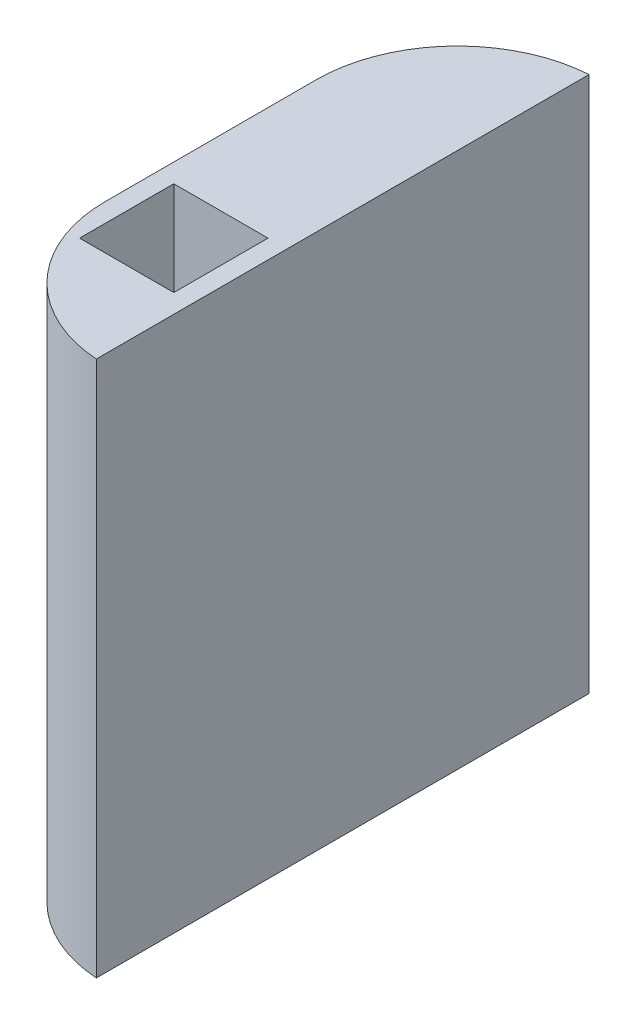
ISO-10303-21;
HEADER;
FILE_DESCRIPTION(('STEP AP214'),'2;1');
FILE_NAME('part.step','',(''),(''),'','','');
FILE_SCHEMA(('AUTOMOTIVE_DESIGN { 1 0 10303 214 1 1 1 1 }'));
ENDSEC;
DATA;
#1=APPLICATION_CONTEXT('core data for automotive mechanical design processes');
#2=APPLICATION_PROTOCOL_DEFINITION('international standard','automotive_design',2000,#1);
#3=PRODUCT_CONTEXT('',#1,'mechanical');
#4=PRODUCT('Part','Part','',(#3));
#5=PRODUCT_RELATED_PRODUCT_CATEGORY('part','',(#4));
#6=PRODUCT_DEFINITION_FORMATION('','',#4);
#7=PRODUCT_DEFINITION_CONTEXT('part definition',#1,'design');
#8=PRODUCT_DEFINITION('design','',#6,#7);
#9=PRODUCT_DEFINITION_SHAPE('','',#8);
#10=(LENGTH_UNIT() NAMED_UNIT(*) SI_UNIT(.MILLI.,.METRE.));
#11=(NAMED_UNIT(*) PLANE_ANGLE_UNIT() SI_UNIT($,.RADIAN.));
#12=(NAMED_UNIT(*) SI_UNIT($,.STERADIAN.) SOLID_ANGLE_UNIT());
#13=UNCERTAINTY_MEASURE_WITH_UNIT(LENGTH_MEASURE(1.E-05),#10,'distance_accuracy_value','');
#14=(GEOMETRIC_REPRESENTATION_CONTEXT(3) GLOBAL_UNCERTAINTY_ASSIGNED_CONTEXT((#13)) GLOBAL_UNIT_ASSIGNED_CONTEXT((#10,
#11,#12)) REPRESENTATION_CONTEXT('',''));
#15=CARTESIAN_POINT('',(0.,0.,0.));
#16=DIRECTION('',(0.,0.,1.));
#17=DIRECTION('',(1.,0.,0.));
#18=AXIS2_PLACEMENT_3D('',#15,#16,#17);
#19=CARTESIAN_POINT('',(0.,56.9,0.));
#20=DIRECTION('',(0.,1.,0.));
#21=DIRECTION('',(0.,0.,1.));
#22=AXIS2_PLACEMENT_3D('',#19,#20,#21);
#23=PLANE('',#22);
#24=DIRECTION('',(0.,0.,-1.));
#25=VECTOR('',#24,1.);
#26=CARTESIAN_POINT('',(7.,56.9,-26.15));
#27=LINE('',#26,#25);
#28=CARTESIAN_POINT('',(7.,56.9,26.15));
#29=VERTEX_POINT('',#28);
#30=CARTESIAN_POINT('',(7.,56.9,-26.15));
#31=VERTEX_POINT('',#30);
#32=EDGE_CURVE('E143',#29,#31,#27,.T.);
#33=ORIENTED_EDGE('',*,*,#32,.T.);
#34=CARTESIAN_POINT('',(8.,56.9,-11.1833704529042));
#35=DIRECTION('',(0.,1.,0.));
#36=DIRECTION('',(0.,0.,1.));
#37=AXIS2_PLACEMENT_3D('',#34,#35,#36);
#38=CIRCLE('',#37,15.);
#39=CARTESIAN_POINT('',(-7.,56.9,-11.1833704529042));
#40=VERTEX_POINT('',#39);
#41=EDGE_CURVE('E11',#31,#40,#38,.T.);
#42=ORIENTED_EDGE('',*,*,#41,.T.);
#43=DIRECTION('',(0.,0.,1.));
#44=VECTOR('',#43,1.);
#45=CARTESIAN_POINT('',(-7.,56.9,-26.15));
#46=LINE('',#45,#44);
#47=CARTESIAN_POINT('',(-7.,56.9,11.1833704529042));
#48=VERTEX_POINT('',#47);
#49=EDGE_CURVE('E145',#40,#48,#46,.T.);
#50=ORIENTED_EDGE('',*,*,#49,.T.);
#51=CARTESIAN_POINT('',(8.,56.9,11.1833704529042));
#52=DIRECTION('',(0.,1.,0.));
#53=DIRECTION('',(0.,0.,1.));
#54=AXIS2_PLACEMENT_3D('',#51,#52,#53);
#55=CIRCLE('',#54,15.);
#56=EDGE_CURVE('E44',#48,#29,#55,.T.);
#57=ORIENTED_EDGE('',*,*,#56,.T.);
#58=EDGE_LOOP('',(#33,#42,#50,#57));
#59=FACE_BOUND('',#58,.T.);
#60=DIRECTION('',(1.,0.,0.));
#61=VECTOR('',#60,1.);
#62=CARTESIAN_POINT('',(0.,56.9,5.93));
#63=LINE('',#62,#61);
#64=CARTESIAN_POINT('',(-5.,56.9,5.93));
#65=VERTEX_POINT('',#64);
#66=CARTESIAN_POINT('',(5.,56.9,5.93));
#67=VERTEX_POINT('',#66);
#68=EDGE_CURVE('E133',#65,#67,#63,.T.);
#69=ORIENTED_EDGE('',*,*,#68,.T.);
#70=DIRECTION('',(0.,0.,1.));
#71=VECTOR('',#70,1.);
#72=CARTESIAN_POINT('',(5.,56.9,0.));
#73=LINE('',#72,#71);
#74=CARTESIAN_POINT('',(5.,56.9,15.93));
#75=VERTEX_POINT('',#74);
#76=EDGE_CURVE('E118',#67,#75,#73,.T.);
#77=ORIENTED_EDGE('',*,*,#76,.T.);
#78=DIRECTION('',(1.,0.,0.));
#79=VECTOR('',#78,1.);
#80=CARTESIAN_POINT('',(0.,56.9,15.93));
#81=LINE('',#80,#79);
#82=CARTESIAN_POINT('',(-5.,56.9,15.93));
#83=VERTEX_POINT('',#82);
#84=EDGE_CURVE('E124',#83,#75,#81,.T.);
#85=ORIENTED_EDGE('',*,*,#84,.F.);
#86=DIRECTION('',(0.,0.,1.));
#87=VECTOR('',#86,1.);
#88=CARTESIAN_POINT('',(-5.,56.9,0.));
#89=LINE('',#88,#87);
#90=EDGE_CURVE('E127',#65,#83,#89,.T.);
#91=ORIENTED_EDGE('',*,*,#90,.F.);
#92=EDGE_LOOP('',(#69,#77,#85,#91));
#93=FACE_BOUND('',#92,.T.);
#94=ADVANCED_FACE('F36',(#59,#93),#23,.T.);
#95=CARTESIAN_POINT('',(0.,0.,0.));
#96=DIRECTION('',(0.,1.,0.));
#97=DIRECTION('',(0.,0.,1.));
#98=AXIS2_PLACEMENT_3D('',#95,#96,#97);
#99=PLANE('',#98);
#100=DIRECTION('',(0.,0.,1.));
#101=VECTOR('',#100,1.);
#102=CARTESIAN_POINT('',(-7.,0.,-26.15));
#103=LINE('',#102,#101);
#104=CARTESIAN_POINT('',(-7.,0.,-11.1833704529042));
#105=VERTEX_POINT('',#104);
#106=CARTESIAN_POINT('',(-7.,0.,11.1833704529042));
#107=VERTEX_POINT('',#106);
#108=EDGE_CURVE('E146',#105,#107,#103,.T.);
#109=ORIENTED_EDGE('',*,*,#108,.F.);
#110=CARTESIAN_POINT('',(8.,0.,-11.1833704529042));
#111=DIRECTION('',(0.,1.,0.));
#112=DIRECTION('',(0.,0.,1.));
#113=AXIS2_PLACEMENT_3D('',#110,#111,#112);
#114=CIRCLE('',#113,15.);
#115=CARTESIAN_POINT('',(7.,0.,-26.15));
#116=VERTEX_POINT('',#115);
#117=EDGE_CURVE('E163',#105,#116,#114,.F.);
#118=ORIENTED_EDGE('',*,*,#117,.T.);
#119=DIRECTION('',(0.,0.,-1.));
#120=VECTOR('',#119,1.);
#121=CARTESIAN_POINT('',(7.,0.,-26.15));
#122=LINE('',#121,#120);
#123=CARTESIAN_POINT('',(7.,0.,26.15));
#124=VERTEX_POINT('',#123);
#125=EDGE_CURVE('E139',#124,#116,#122,.T.);
#126=ORIENTED_EDGE('',*,*,#125,.F.);
#127=CARTESIAN_POINT('',(8.,0.,11.1833704529042));
#128=DIRECTION('',(0.,1.,0.));
#129=DIRECTION('',(0.,0.,1.));
#130=AXIS2_PLACEMENT_3D('',#127,#128,#129);
#131=CIRCLE('',#130,15.);
#132=EDGE_CURVE('E161',#124,#107,#131,.F.);
#133=ORIENTED_EDGE('',*,*,#132,.T.);
#134=EDGE_LOOP('',(#109,#118,#126,#133));
#135=FACE_BOUND('',#134,.T.);
#136=DIRECTION('',(0.,0.,1.));
#137=VECTOR('',#136,1.);
#138=CARTESIAN_POINT('',(5.,0.,0.));
#139=LINE('',#138,#137);
#140=CARTESIAN_POINT('',(5.,0.,5.93));
#141=VERTEX_POINT('',#140);
#142=CARTESIAN_POINT('',(5.,0.,15.93));
#143=VERTEX_POINT('',#142);
#144=EDGE_CURVE('E112',#141,#143,#139,.T.);
#145=ORIENTED_EDGE('',*,*,#144,.F.);
#146=DIRECTION('',(1.,0.,0.));
#147=VECTOR('',#146,1.);
#148=CARTESIAN_POINT('',(0.,0.,5.93));
#149=LINE('',#148,#147);
#150=CARTESIAN_POINT('',(-5.,0.,5.93));
#151=VERTEX_POINT('',#150);
#152=EDGE_CURVE('E101',#151,#141,#149,.T.);
#153=ORIENTED_EDGE('',*,*,#152,.F.);
#154=DIRECTION('',(0.,0.,1.));
#155=VECTOR('',#154,1.);
#156=CARTESIAN_POINT('',(-5.,0.,0.));
#157=LINE('',#156,#155);
#158=CARTESIAN_POINT('',(-5.,0.,15.93));
#159=VERTEX_POINT('',#158);
#160=EDGE_CURVE('E111',#151,#159,#157,.T.);
#161=ORIENTED_EDGE('',*,*,#160,.T.);
#162=DIRECTION('',(1.,0.,0.));
#163=VECTOR('',#162,1.);
#164=CARTESIAN_POINT('',(0.,0.,15.93));
#165=LINE('',#164,#163);
#166=EDGE_CURVE('E119',#159,#143,#165,.T.);
#167=ORIENTED_EDGE('',*,*,#166,.T.);
#168=EDGE_LOOP('',(#145,#153,#161,#167));
#169=FACE_BOUND('',#168,.T.);
#170=ADVANCED_FACE('F122',(#135,#169),#99,.F.);
#171=CARTESIAN_POINT('',(7.,56.9,-26.15));
#172=DIRECTION('',(-1.,0.,0.));
#173=DIRECTION('',(0.,0.,1.));
#174=AXIS2_PLACEMENT_3D('',#171,#172,#173);
#175=PLANE('',#174);
#176=ORIENTED_EDGE('',*,*,#125,.T.);
#177=DIRECTION('',(0.,-1.,0.));
#178=VECTOR('',#177,1.);
#179=CARTESIAN_POINT('',(7.,56.9,-26.15));
#180=LINE('',#179,#178);
#181=EDGE_CURVE('E154',#31,#116,#180,.T.);
#182=ORIENTED_EDGE('',*,*,#181,.F.);
#183=ORIENTED_EDGE('',*,*,#32,.F.);
#184=DIRECTION('',(0.,-1.,0.));
#185=VECTOR('',#184,1.);
#186=CARTESIAN_POINT('',(7.,56.9,26.15));
#187=LINE('',#186,#185);
#188=EDGE_CURVE('E148',#29,#124,#187,.T.);
#189=ORIENTED_EDGE('',*,*,#188,.T.);
#190=EDGE_LOOP('',(#176,#182,#183,#189));
#191=FACE_BOUND('',#190,.T.);
#192=ADVANCED_FACE('F171',(#191),#175,.F.);
#193=CARTESIAN_POINT('',(-7.,56.9,-26.15));
#194=DIRECTION('',(1.,0.,0.));
#195=DIRECTION('',(0.,0.,-1.));
#196=AXIS2_PLACEMENT_3D('',#193,#194,#195);
#197=PLANE('',#196);
#198=ORIENTED_EDGE('',*,*,#49,.F.);
#199=DIRECTION('',(0.,-1.,0.));
#200=VECTOR('',#199,1.);
#201=CARTESIAN_POINT('',(-7.,56.9,-11.1833704529042));
#202=LINE('',#201,#200);
#203=EDGE_CURVE('E158',#40,#105,#202,.T.);
#204=ORIENTED_EDGE('',*,*,#203,.T.);
#205=ORIENTED_EDGE('',*,*,#108,.T.);
#206=DIRECTION('',(0.,1.,0.));
#207=VECTOR('',#206,1.);
#208=CARTESIAN_POINT('',(-7.,56.9,11.1833704529042));
#209=LINE('',#208,#207);
#210=EDGE_CURVE('E51',#107,#48,#209,.T.);
#211=ORIENTED_EDGE('',*,*,#210,.T.);
#212=EDGE_LOOP('',(#198,#204,#205,#211));
#213=FACE_BOUND('',#212,.T.);
#214=ADVANCED_FACE('F175',(#213),#197,.F.);
#215=CARTESIAN_POINT('',(5.,0.,0.));
#216=DIRECTION('',(-1.,0.,0.));
#217=DIRECTION('',(0.,0.,1.));
#218=AXIS2_PLACEMENT_3D('',#215,#216,#217);
#219=PLANE('',#218);
#220=ORIENTED_EDGE('',*,*,#76,.F.);
#221=DIRECTION('',(0.,1.,0.));
#222=VECTOR('',#221,1.);
#223=CARTESIAN_POINT('',(5.,0.,5.93));
#224=LINE('',#223,#222);
#225=EDGE_CURVE('E105',#141,#67,#224,.T.);
#226=ORIENTED_EDGE('',*,*,#225,.F.);
#227=ORIENTED_EDGE('',*,*,#144,.T.);
#228=DIRECTION('',(0.,1.,0.));
#229=VECTOR('',#228,1.);
#230=CARTESIAN_POINT('',(5.,0.,15.93));
#231=LINE('',#230,#229);
#232=EDGE_CURVE('E137',#143,#75,#231,.T.);
#233=ORIENTED_EDGE('',*,*,#232,.T.);
#234=EDGE_LOOP('',(#220,#226,#227,#233));
#235=FACE_BOUND('',#234,.T.);
#236=ADVANCED_FACE('F115',(#235),#219,.T.);
#237=CARTESIAN_POINT('',(0.,0.,15.93));
#238=DIRECTION('',(0.,0.,1.));
#239=DIRECTION('',(1.,0.,0.));
#240=AXIS2_PLACEMENT_3D('',#237,#238,#239);
#241=PLANE('',#240);
#242=ORIENTED_EDGE('',*,*,#84,.T.);
#243=ORIENTED_EDGE('',*,*,#232,.F.);
#244=ORIENTED_EDGE('',*,*,#166,.F.);
#245=DIRECTION('',(0.,1.,0.));
#246=VECTOR('',#245,1.);
#247=CARTESIAN_POINT('',(-5.,0.,15.93));
#248=LINE('',#247,#246);
#249=EDGE_CURVE('E140',#159,#83,#248,.T.);
#250=ORIENTED_EDGE('',*,*,#249,.T.);
#251=EDGE_LOOP('',(#242,#243,#244,#250));
#252=FACE_BOUND('',#251,.T.);
#253=ADVANCED_FACE('F212',(#252),#241,.F.);
#254=CARTESIAN_POINT('',(-5.,0.,0.));
#255=DIRECTION('',(-1.,0.,0.));
#256=DIRECTION('',(0.,0.,1.));
#257=AXIS2_PLACEMENT_3D('',#254,#255,#256);
#258=PLANE('',#257);
#259=ORIENTED_EDGE('',*,*,#90,.T.);
#260=ORIENTED_EDGE('',*,*,#249,.F.);
#261=ORIENTED_EDGE('',*,*,#160,.F.);
#262=DIRECTION('',(0.,1.,0.));
#263=VECTOR('',#262,1.);
#264=CARTESIAN_POINT('',(-5.,0.,5.93));
#265=LINE('',#264,#263);
#266=EDGE_CURVE('E107',#151,#65,#265,.T.);
#267=ORIENTED_EDGE('',*,*,#266,.T.);
#268=EDGE_LOOP('',(#259,#260,#261,#267));
#269=FACE_BOUND('',#268,.T.);
#270=ADVANCED_FACE('F184',(#269),#258,.F.);
#271=CARTESIAN_POINT('',(0.,0.,5.93));
#272=DIRECTION('',(0.,0.,1.));
#273=DIRECTION('',(1.,0.,0.));
#274=AXIS2_PLACEMENT_3D('',#271,#272,#273);
#275=PLANE('',#274);
#276=ORIENTED_EDGE('',*,*,#68,.F.);
#277=ORIENTED_EDGE('',*,*,#266,.F.);
#278=ORIENTED_EDGE('',*,*,#152,.T.);
#279=ORIENTED_EDGE('',*,*,#225,.T.);
#280=EDGE_LOOP('',(#276,#277,#278,#279));
#281=FACE_BOUND('',#280,.T.);
#282=ADVANCED_FACE('F104',(#281),#275,.T.);
#283=CARTESIAN_POINT('',(8.,56.9,-11.1833704529042));
#284=DIRECTION('',(0.,-1.,0.));
#285=DIRECTION('',(0.,0.,-1.));
#286=AXIS2_PLACEMENT_3D('',#283,#284,#285);
#287=CYLINDRICAL_SURFACE('',#286,15.);
#288=ORIENTED_EDGE('',*,*,#41,.F.);
#289=ORIENTED_EDGE('',*,*,#181,.T.);
#290=ORIENTED_EDGE('',*,*,#117,.F.);
#291=ORIENTED_EDGE('',*,*,#203,.F.);
#292=EDGE_LOOP('',(#288,#289,#290,#291));
#293=FACE_BOUND('',#292,.T.);
#294=ADVANCED_FACE('F178',(#293),#287,.T.);
#295=CARTESIAN_POINT('',(8.,56.9,11.1833704529042));
#296=DIRECTION('',(0.,1.,0.));
#297=DIRECTION('',(0.,0.,1.));
#298=AXIS2_PLACEMENT_3D('',#295,#296,#297);
#299=CYLINDRICAL_SURFACE('',#298,15.);
#300=ORIENTED_EDGE('',*,*,#56,.F.);
#301=ORIENTED_EDGE('',*,*,#210,.F.);
#302=ORIENTED_EDGE('',*,*,#132,.F.);
#303=ORIENTED_EDGE('',*,*,#188,.F.);
#304=EDGE_LOOP('',(#300,#301,#302,#303));
#305=FACE_BOUND('',#304,.T.);
#306=ADVANCED_FACE('F38',(#305),#299,.T.);
#307=CLOSED_SHELL('',(#94,#170,#192,#214,#236,#253,#270,#282,#294,#306));
#308=MANIFOLD_SOLID_BREP('B2',#307);
#309=ADVANCED_BREP_SHAPE_REPRESENTATION('',(#18,#308),#14);
#310=SHAPE_DEFINITION_REPRESENTATION(#9,#309);
ENDSEC;
END-ISO-10303-21;
